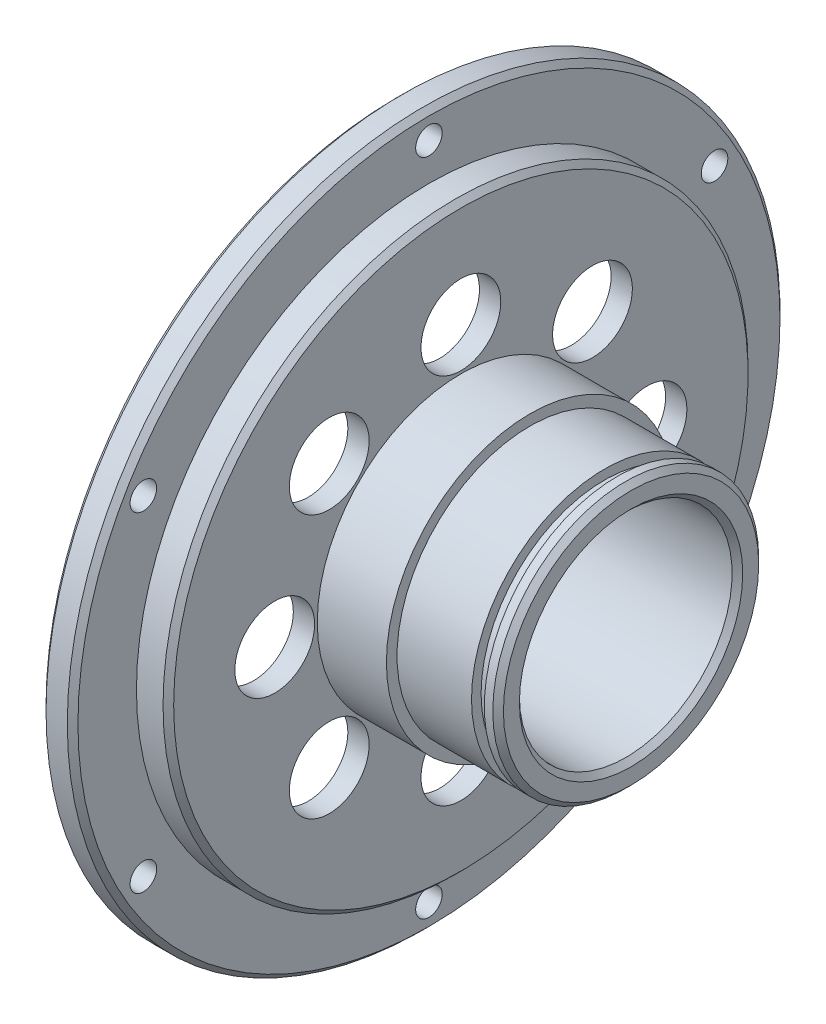
ISO-10303-21;
HEADER;
FILE_DESCRIPTION(('STEP AP214'),'2;1');
FILE_NAME('part.step','',(''),(''),'','','');
FILE_SCHEMA(('AUTOMOTIVE_DESIGN { 1 0 10303 214 1 1 1 1 }'));
ENDSEC;
DATA;
#1=APPLICATION_CONTEXT('core data for automotive mechanical design processes');
#2=APPLICATION_PROTOCOL_DEFINITION('international standard','automotive_design',2000,#1);
#3=PRODUCT_CONTEXT('',#1,'mechanical');
#4=PRODUCT('Part','Part','',(#3));
#5=PRODUCT_RELATED_PRODUCT_CATEGORY('part','',(#4));
#6=PRODUCT_DEFINITION_FORMATION('','',#4);
#7=PRODUCT_DEFINITION_CONTEXT('part definition',#1,'design');
#8=PRODUCT_DEFINITION('design','',#6,#7);
#9=PRODUCT_DEFINITION_SHAPE('','',#8);
#10=(LENGTH_UNIT() NAMED_UNIT(*) SI_UNIT(.MILLI.,.METRE.));
#11=(NAMED_UNIT(*) PLANE_ANGLE_UNIT() SI_UNIT($,.RADIAN.));
#12=(NAMED_UNIT(*) SI_UNIT($,.STERADIAN.) SOLID_ANGLE_UNIT());
#13=UNCERTAINTY_MEASURE_WITH_UNIT(LENGTH_MEASURE(1.E-05),#10,'distance_accuracy_value','');
#14=(GEOMETRIC_REPRESENTATION_CONTEXT(3) GLOBAL_UNCERTAINTY_ASSIGNED_CONTEXT((#13)) GLOBAL_UNIT_ASSIGNED_CONTEXT((#10,
#11,#12)) REPRESENTATION_CONTEXT('',''));
#15=CARTESIAN_POINT('',(0.,0.,0.));
#16=DIRECTION('',(0.,0.,1.));
#17=DIRECTION('',(1.,0.,0.));
#18=AXIS2_PLACEMENT_3D('',#15,#16,#17);
#19=CARTESIAN_POINT('',(22.,10.,0.));
#20=DIRECTION('',(-1.,0.,0.));
#21=DIRECTION('',(0.,0.,1.));
#22=AXIS2_PLACEMENT_3D('',#19,#20,#21);
#23=PLANE('',#22);
#24=CARTESIAN_POINT('',(22.,0.,0.));
#25=DIRECTION('',(-1.,0.,0.));
#26=DIRECTION('',(0.,0.,1.));
#27=AXIS2_PLACEMENT_3D('',#24,#25,#26);
#28=CIRCLE('',#27,12.);
#29=CARTESIAN_POINT('',(22.,0.,12.));
#30=VERTEX_POINT('',#29);
#31=EDGE_CURVE('E47',#30,#30,#28,.F.);
#32=ORIENTED_EDGE('',*,*,#31,.T.);
#33=EDGE_LOOP('',(#32));
#34=FACE_BOUND('',#33,.T.);
#35=CARTESIAN_POINT('',(22.,0.,0.));
#36=DIRECTION('',(-1.,0.,0.));
#37=DIRECTION('',(0.,0.,1.));
#38=AXIS2_PLACEMENT_3D('',#35,#36,#37);
#39=CIRCLE('',#38,10.5);
#40=CARTESIAN_POINT('',(22.,0.,10.5));
#41=VERTEX_POINT('',#40);
#42=EDGE_CURVE('E55',#41,#41,#39,.T.);
#43=ORIENTED_EDGE('',*,*,#42,.T.);
#44=EDGE_LOOP('',(#43));
#45=FACE_BOUND('',#44,.T.);
#46=ADVANCED_FACE('F39',(#34,#45),#23,.F.);
#47=CARTESIAN_POINT('',(0.,0.,0.));
#48=DIRECTION('',(-1.,0.,0.));
#49=DIRECTION('',(0.,0.,1.));
#50=AXIS2_PLACEMENT_3D('',#47,#48,#49);
#51=CYLINDRICAL_SURFACE('',#50,13.5);
#52=CARTESIAN_POINT('',(6.,0.,0.));
#53=DIRECTION('',(-1.,0.,0.));
#54=DIRECTION('',(0.,0.,1.));
#55=AXIS2_PLACEMENT_3D('',#52,#53,#54);
#56=CIRCLE('',#55,13.5);
#57=CARTESIAN_POINT('',(6.,0.,13.5));
#58=VERTEX_POINT('',#57);
#59=EDGE_CURVE('E113',#58,#58,#56,.T.);
#60=ORIENTED_EDGE('',*,*,#59,.F.);
#61=EDGE_LOOP('',(#60));
#62=FACE_BOUND('',#61,.T.);
#63=CARTESIAN_POINT('',(12.5,0.,0.));
#64=DIRECTION('',(1.,0.,0.));
#65=DIRECTION('',(0.,0.,-1.));
#66=AXIS2_PLACEMENT_3D('',#63,#64,#65);
#67=CIRCLE('',#66,13.5);
#68=CARTESIAN_POINT('',(12.5,0.,-13.5));
#69=VERTEX_POINT('',#68);
#70=EDGE_CURVE('E62',#69,#69,#67,.T.);
#71=ORIENTED_EDGE('',*,*,#70,.F.);
#72=EDGE_LOOP('',(#71));
#73=FACE_BOUND('',#72,.T.);
#74=ADVANCED_FACE('F218',(#62,#73),#51,.T.);
#75=CARTESIAN_POINT('',(0.,0.,0.));
#76=DIRECTION('',(-1.,0.,0.));
#77=DIRECTION('',(0.,0.,1.));
#78=AXIS2_PLACEMENT_3D('',#75,#76,#77);
#79=CYLINDRICAL_SURFACE('',#78,33.5);
#80=CARTESIAN_POINT('',(2.50000000000001,0.,0.));
#81=DIRECTION('',(-1.,0.,0.));
#82=DIRECTION('',(0.,0.,1.));
#83=AXIS2_PLACEMENT_3D('',#80,#81,#82);
#84=CIRCLE('',#83,33.5);
#85=CARTESIAN_POINT('',(2.50000000000001,0.,33.5));
#86=VERTEX_POINT('',#85);
#87=EDGE_CURVE('E92',#86,#86,#84,.T.);
#88=ORIENTED_EDGE('',*,*,#87,.T.);
#89=EDGE_LOOP('',(#88));
#90=FACE_BOUND('',#89,.T.);
#91=CARTESIAN_POINT('',(0.499999999999987,0.,0.));
#92=DIRECTION('',(1.,0.,0.));
#93=DIRECTION('',(0.,0.,-1.));
#94=AXIS2_PLACEMENT_3D('',#91,#92,#93);
#95=CIRCLE('',#94,33.5);
#96=CARTESIAN_POINT('',(0.499999999999987,0.,-33.5));
#97=VERTEX_POINT('',#96);
#98=EDGE_CURVE('E95',#97,#97,#95,.T.);
#99=ORIENTED_EDGE('',*,*,#98,.T.);
#100=EDGE_LOOP('',(#99));
#101=FACE_BOUND('',#100,.T.);
#102=ADVANCED_FACE('F220',(#90,#101),#79,.T.);
#103=CARTESIAN_POINT('',(0.,33.5,0.));
#104=DIRECTION('',(1.,0.,0.));
#105=DIRECTION('',(0.,0.,-1.));
#106=AXIS2_PLACEMENT_3D('',#103,#104,#105);
#107=PLANE('',#106);
#108=CARTESIAN_POINT('',(0.,15.5000000000003,26.8467875173174));
#109=DIRECTION('',(1.,0.,0.));
#110=DIRECTION('',(0.,0.,-1.));
#111=AXIS2_PLACEMENT_3D('',#108,#109,#110);
#112=CIRCLE('',#111,1.25);
#113=CARTESIAN_POINT('',(0.,15.5000000000003,25.5967875173174));
#114=VERTEX_POINT('',#113);
#115=EDGE_CURVE('E197',#114,#114,#112,.T.);
#116=ORIENTED_EDGE('',*,*,#115,.T.);
#117=EDGE_LOOP('',(#116));
#118=FACE_BOUND('',#117,.T.);
#119=CARTESIAN_POINT('',(0.,-15.4999999999997,26.8467875173177));
#120=DIRECTION('',(1.,0.,0.));
#121=DIRECTION('',(0.,0.,-1.));
#122=AXIS2_PLACEMENT_3D('',#119,#120,#121);
#123=CIRCLE('',#122,1.25);
#124=CARTESIAN_POINT('',(0.,-15.4999999999997,25.5967875173177));
#125=VERTEX_POINT('',#124);
#126=EDGE_CURVE('E191',#125,#125,#123,.T.);
#127=ORIENTED_EDGE('',*,*,#126,.T.);
#128=EDGE_LOOP('',(#127));
#129=FACE_BOUND('',#128,.T.);
#130=CARTESIAN_POINT('',(0.,-31.,0.));
#131=DIRECTION('',(1.,0.,0.));
#132=DIRECTION('',(0.,0.,-1.));
#133=AXIS2_PLACEMENT_3D('',#130,#131,#132);
#134=CIRCLE('',#133,1.25);
#135=CARTESIAN_POINT('',(0.,-31.,-1.25));
#136=VERTEX_POINT('',#135);
#137=EDGE_CURVE('E185',#136,#136,#134,.T.);
#138=ORIENTED_EDGE('',*,*,#137,.T.);
#139=EDGE_LOOP('',(#138));
#140=FACE_BOUND('',#139,.T.);
#141=CARTESIAN_POINT('',(0.,-15.5000000000001,-26.8467875173175));
#142=DIRECTION('',(1.,0.,0.));
#143=DIRECTION('',(0.,0.,-1.));
#144=AXIS2_PLACEMENT_3D('',#141,#142,#143);
#145=CIRCLE('',#144,1.25);
#146=CARTESIAN_POINT('',(0.,-15.5000000000001,-28.0967875173175));
#147=VERTEX_POINT('',#146);
#148=EDGE_CURVE('E179',#147,#147,#145,.T.);
#149=ORIENTED_EDGE('',*,*,#148,.T.);
#150=EDGE_LOOP('',(#149));
#151=FACE_BOUND('',#150,.T.);
#152=CARTESIAN_POINT('',(0.,15.4999999999999,-26.8467875173176));
#153=DIRECTION('',(1.,0.,0.));
#154=DIRECTION('',(0.,0.,-1.));
#155=AXIS2_PLACEMENT_3D('',#152,#153,#154);
#156=CIRCLE('',#155,1.25);
#157=CARTESIAN_POINT('',(0.,15.4999999999999,-28.0967875173176));
#158=VERTEX_POINT('',#157);
#159=EDGE_CURVE('E173',#158,#158,#156,.T.);
#160=ORIENTED_EDGE('',*,*,#159,.T.);
#161=EDGE_LOOP('',(#160));
#162=FACE_BOUND('',#161,.T.);
#163=CARTESIAN_POINT('',(0.,31.,0.));
#164=DIRECTION('',(1.,0.,0.));
#165=DIRECTION('',(0.,0.,-1.));
#166=AXIS2_PLACEMENT_3D('',#163,#164,#165);
#167=CIRCLE('',#166,1.25);
#168=CARTESIAN_POINT('',(0.,31.,-1.25));
#169=VERTEX_POINT('',#168);
#170=EDGE_CURVE('E151',#169,#169,#167,.T.);
#171=ORIENTED_EDGE('',*,*,#170,.T.);
#172=EDGE_LOOP('',(#171));
#173=FACE_BOUND('',#172,.T.);
#174=CARTESIAN_POINT('',(0.,0.,0.));
#175=DIRECTION('',(1.,0.,0.));
#176=DIRECTION('',(0.,0.,-1.));
#177=AXIS2_PLACEMENT_3D('',#174,#175,#176);
#178=CIRCLE('',#177,33.);
#179=CARTESIAN_POINT('',(0.,0.,-33.));
#180=VERTEX_POINT('',#179);
#181=EDGE_CURVE('E83',#180,#180,#178,.F.);
#182=ORIENTED_EDGE('',*,*,#181,.T.);
#183=EDGE_LOOP('',(#182));
#184=FACE_BOUND('',#183,.T.);
#185=CARTESIAN_POINT('',(0.,0.,0.));
#186=DIRECTION('',(1.,0.,0.));
#187=DIRECTION('',(0.,0.,-1.));
#188=AXIS2_PLACEMENT_3D('',#185,#186,#187);
#189=CIRCLE('',#188,26.);
#190=CARTESIAN_POINT('',(0.,0.,-26.));
#191=VERTEX_POINT('',#190);
#192=EDGE_CURVE('E86',#191,#191,#189,.T.);
#193=ORIENTED_EDGE('',*,*,#192,.T.);
#194=EDGE_LOOP('',(#193));
#195=FACE_BOUND('',#194,.T.);
#196=ADVANCED_FACE('F228',(#118,#129,#140,#151,#162,#173,#184,#195),#107,.F.);
#197=CARTESIAN_POINT('',(0.,0.,0.));
#198=DIRECTION('',(-1.,0.,0.));
#199=DIRECTION('',(0.,0.,1.));
#200=AXIS2_PLACEMENT_3D('',#197,#198,#199);
#201=CYLINDRICAL_SURFACE('',#200,25.5);
#202=CARTESIAN_POINT('',(0.500000000000001,0.,0.));
#203=DIRECTION('',(1.,0.,0.));
#204=DIRECTION('',(0.,0.,-1.));
#205=AXIS2_PLACEMENT_3D('',#202,#203,#204);
#206=CIRCLE('',#205,25.5);
#207=CARTESIAN_POINT('',(0.500000000000001,0.,-25.5));
#208=VERTEX_POINT('',#207);
#209=EDGE_CURVE('E74',#208,#208,#206,.F.);
#210=ORIENTED_EDGE('',*,*,#209,.T.);
#211=EDGE_LOOP('',(#210));
#212=FACE_BOUND('',#211,.T.);
#213=CARTESIAN_POINT('',(4.,0.,0.));
#214=DIRECTION('',(-1.,0.,0.));
#215=DIRECTION('',(0.,0.,1.));
#216=AXIS2_PLACEMENT_3D('',#213,#214,#215);
#217=CIRCLE('',#216,25.5);
#218=CARTESIAN_POINT('',(4.,0.,25.5));
#219=VERTEX_POINT('',#218);
#220=EDGE_CURVE('E98',#219,#219,#217,.T.);
#221=ORIENTED_EDGE('',*,*,#220,.F.);
#222=EDGE_LOOP('',(#221));
#223=FACE_BOUND('',#222,.T.);
#224=ADVANCED_FACE('F266',(#212,#223),#201,.F.);
#225=CARTESIAN_POINT('',(4.,25.5,0.));
#226=DIRECTION('',(1.,0.,0.));
#227=DIRECTION('',(0.,0.,-1.));
#228=AXIS2_PLACEMENT_3D('',#225,#226,#227);
#229=PLANE('',#228);
#230=CARTESIAN_POINT('',(4.,12.3743686707646,12.3743686707646));
#231=DIRECTION('',(1.,0.,0.));
#232=DIRECTION('',(0.,0.,-1.));
#233=AXIS2_PLACEMENT_3D('',#230,#231,#232);
#234=CIRCLE('',#233,3.75);
#235=CARTESIAN_POINT('',(4.,12.3743686707646,8.62436867076459));
#236=VERTEX_POINT('',#235);
#237=EDGE_CURVE('E119',#236,#236,#234,.T.);
#238=ORIENTED_EDGE('',*,*,#237,.T.);
#239=EDGE_LOOP('',(#238));
#240=FACE_BOUND('',#239,.T.);
#241=CARTESIAN_POINT('',(4.,0.,17.5));
#242=DIRECTION('',(1.,0.,0.));
#243=DIRECTION('',(0.,0.,-1.));
#244=AXIS2_PLACEMENT_3D('',#241,#242,#243);
#245=CIRCLE('',#244,3.75);
#246=CARTESIAN_POINT('',(4.,0.,13.75));
#247=VERTEX_POINT('',#246);
#248=EDGE_CURVE('E122',#247,#247,#245,.T.);
#249=ORIENTED_EDGE('',*,*,#248,.T.);
#250=EDGE_LOOP('',(#249));
#251=FACE_BOUND('',#250,.T.);
#252=CARTESIAN_POINT('',(4.,-12.3743686707646,12.3743686707646));
#253=DIRECTION('',(1.,0.,0.));
#254=DIRECTION('',(0.,0.,-1.));
#255=AXIS2_PLACEMENT_3D('',#252,#253,#254);
#256=CIRCLE('',#255,3.75);
#257=CARTESIAN_POINT('',(4.,-12.3743686707646,8.62436867076459));
#258=VERTEX_POINT('',#257);
#259=EDGE_CURVE('E125',#258,#258,#256,.T.);
#260=ORIENTED_EDGE('',*,*,#259,.T.);
#261=EDGE_LOOP('',(#260));
#262=FACE_BOUND('',#261,.T.);
#263=CARTESIAN_POINT('',(4.,-12.3743686707646,-12.3743686707646));
#264=DIRECTION('',(1.,0.,0.));
#265=DIRECTION('',(0.,0.,-1.));
#266=AXIS2_PLACEMENT_3D('',#263,#264,#265);
#267=CIRCLE('',#266,3.75);
#268=CARTESIAN_POINT('',(4.,-12.3743686707646,-16.1243686707646));
#269=VERTEX_POINT('',#268);
#270=EDGE_CURVE('E128',#269,#269,#267,.T.);
#271=ORIENTED_EDGE('',*,*,#270,.T.);
#272=EDGE_LOOP('',(#271));
#273=FACE_BOUND('',#272,.T.);
#274=CARTESIAN_POINT('',(4.,0.,-17.5));
#275=DIRECTION('',(1.,0.,0.));
#276=DIRECTION('',(0.,0.,-1.));
#277=AXIS2_PLACEMENT_3D('',#274,#275,#276);
#278=CIRCLE('',#277,3.75);
#279=CARTESIAN_POINT('',(4.,0.,-21.25));
#280=VERTEX_POINT('',#279);
#281=EDGE_CURVE('E131',#280,#280,#278,.T.);
#282=ORIENTED_EDGE('',*,*,#281,.T.);
#283=EDGE_LOOP('',(#282));
#284=FACE_BOUND('',#283,.T.);
#285=CARTESIAN_POINT('',(4.,12.3743686707646,-12.3743686707646));
#286=DIRECTION('',(1.,0.,0.));
#287=DIRECTION('',(0.,0.,-1.));
#288=AXIS2_PLACEMENT_3D('',#285,#286,#287);
#289=CIRCLE('',#288,3.75);
#290=CARTESIAN_POINT('',(4.,12.3743686707646,-16.1243686707646));
#291=VERTEX_POINT('',#290);
#292=EDGE_CURVE('E134',#291,#291,#289,.T.);
#293=ORIENTED_EDGE('',*,*,#292,.T.);
#294=EDGE_LOOP('',(#293));
#295=FACE_BOUND('',#294,.T.);
#296=CARTESIAN_POINT('',(4.,17.5,0.));
#297=DIRECTION('',(1.,0.,0.));
#298=DIRECTION('',(0.,0.,-1.));
#299=AXIS2_PLACEMENT_3D('',#296,#297,#298);
#300=CIRCLE('',#299,3.75);
#301=CARTESIAN_POINT('',(4.,17.5,-3.75));
#302=VERTEX_POINT('',#301);
#303=EDGE_CURVE('E137',#302,#302,#300,.T.);
#304=ORIENTED_EDGE('',*,*,#303,.T.);
#305=EDGE_LOOP('',(#304));
#306=FACE_BOUND('',#305,.T.);
#307=CARTESIAN_POINT('',(4.,-17.5,0.));
#308=DIRECTION('',(1.,0.,0.));
#309=DIRECTION('',(0.,0.,-1.));
#310=AXIS2_PLACEMENT_3D('',#307,#308,#309);
#311=CIRCLE('',#310,3.75);
#312=CARTESIAN_POINT('',(4.,-17.5,-3.75));
#313=VERTEX_POINT('',#312);
#314=EDGE_CURVE('E140',#313,#313,#311,.T.);
#315=ORIENTED_EDGE('',*,*,#314,.T.);
#316=EDGE_LOOP('',(#315));
#317=FACE_BOUND('',#316,.T.);
#318=CARTESIAN_POINT('',(4.,0.,0.));
#319=DIRECTION('',(1.,0.,0.));
#320=DIRECTION('',(0.,0.,-1.));
#321=AXIS2_PLACEMENT_3D('',#318,#319,#320);
#322=CIRCLE('',#321,9.49999999999999);
#323=CARTESIAN_POINT('',(4.,0.,-9.49999999999999));
#324=VERTEX_POINT('',#323);
#325=EDGE_CURVE('E68',#324,#324,#322,.T.);
#326=ORIENTED_EDGE('',*,*,#325,.T.);
#327=EDGE_LOOP('',(#326));
#328=FACE_BOUND('',#327,.T.);
#329=ORIENTED_EDGE('',*,*,#220,.T.);
#330=EDGE_LOOP('',(#329));
#331=FACE_BOUND('',#330,.T.);
#332=ADVANCED_FACE('F262',(#240,#251,#262,#273,#284,#295,#306,#317,#328,#331),#229,.F.);
#333=CARTESIAN_POINT('',(0.,0.,0.));
#334=DIRECTION('',(-1.,0.,0.));
#335=DIRECTION('',(0.,0.,1.));
#336=AXIS2_PLACEMENT_3D('',#333,#334,#335);
#337=CYLINDRICAL_SURFACE('',#336,9.);
#338=CARTESIAN_POINT('',(4.5,0.,0.));
#339=DIRECTION('',(1.,0.,0.));
#340=DIRECTION('',(0.,0.,-1.));
#341=AXIS2_PLACEMENT_3D('',#338,#339,#340);
#342=CIRCLE('',#341,9.);
#343=CARTESIAN_POINT('',(4.5,0.,-9.));
#344=VERTEX_POINT('',#343);
#345=EDGE_CURVE('E71',#344,#344,#342,.F.);
#346=ORIENTED_EDGE('',*,*,#345,.T.);
#347=EDGE_LOOP('',(#346));
#348=FACE_BOUND('',#347,.T.);
#349=CARTESIAN_POINT('',(6.,0.,0.));
#350=DIRECTION('',(-1.,0.,0.));
#351=DIRECTION('',(0.,0.,1.));
#352=AXIS2_PLACEMENT_3D('',#349,#350,#351);
#353=CIRCLE('',#352,9.);
#354=CARTESIAN_POINT('',(6.,0.,9.));
#355=VERTEX_POINT('',#354);
#356=EDGE_CURVE('E101',#355,#355,#353,.T.);
#357=ORIENTED_EDGE('',*,*,#356,.F.);
#358=EDGE_LOOP('',(#357));
#359=FACE_BOUND('',#358,.T.);
#360=ADVANCED_FACE('F258',(#348,#359),#337,.F.);
#361=CARTESIAN_POINT('',(6.,9.,0.));
#362=DIRECTION('',(-1.,0.,0.));
#363=DIRECTION('',(0.,0.,1.));
#364=AXIS2_PLACEMENT_3D('',#361,#362,#363);
#365=PLANE('',#364);
#366=CARTESIAN_POINT('',(6.,0.,0.));
#367=DIRECTION('',(-1.,0.,0.));
#368=DIRECTION('',(0.,0.,1.));
#369=AXIS2_PLACEMENT_3D('',#366,#367,#368);
#370=CIRCLE('',#369,10.);
#371=CARTESIAN_POINT('',(6.,0.,10.));
#372=VERTEX_POINT('',#371);
#373=EDGE_CURVE('E104',#372,#372,#370,.T.);
#374=ORIENTED_EDGE('',*,*,#373,.F.);
#375=EDGE_LOOP('',(#374));
#376=FACE_BOUND('',#375,.T.);
#377=ORIENTED_EDGE('',*,*,#356,.T.);
#378=EDGE_LOOP('',(#377));
#379=FACE_BOUND('',#378,.T.);
#380=ADVANCED_FACE('F254',(#376,#379),#365,.F.);
#381=CARTESIAN_POINT('',(0.,0.,0.));
#382=DIRECTION('',(-1.,0.,0.));
#383=DIRECTION('',(0.,0.,1.));
#384=AXIS2_PLACEMENT_3D('',#381,#382,#383);
#385=CYLINDRICAL_SURFACE('',#384,10.);
#386=CARTESIAN_POINT('',(21.5,0.,0.));
#387=DIRECTION('',(-1.,0.,0.));
#388=DIRECTION('',(0.,0.,1.));
#389=AXIS2_PLACEMENT_3D('',#386,#387,#388);
#390=CIRCLE('',#389,10.);
#391=CARTESIAN_POINT('',(21.5,0.,10.));
#392=VERTEX_POINT('',#391);
#393=EDGE_CURVE('E51',#392,#392,#390,.F.);
#394=ORIENTED_EDGE('',*,*,#393,.T.);
#395=EDGE_LOOP('',(#394));
#396=FACE_BOUND('',#395,.T.);
#397=ORIENTED_EDGE('',*,*,#373,.T.);
#398=EDGE_LOOP('',(#397));
#399=FACE_BOUND('',#398,.T.);
#400=ADVANCED_FACE('F251',(#396,#399),#385,.F.);
#401=CARTESIAN_POINT('',(6.,13.5,0.));
#402=DIRECTION('',(-1.,0.,0.));
#403=DIRECTION('',(0.,0.,1.));
#404=AXIS2_PLACEMENT_3D('',#401,#402,#403);
#405=PLANE('',#404);
#406=CARTESIAN_POINT('',(6.,12.3743686707646,12.3743686707646));
#407=DIRECTION('',(1.,0.,0.));
#408=DIRECTION('',(0.,0.,-1.));
#409=AXIS2_PLACEMENT_3D('',#406,#407,#408);
#410=CIRCLE('',#409,3.75);
#411=CARTESIAN_POINT('',(6.,12.3743686707646,8.62436867076459));
#412=VERTEX_POINT('',#411);
#413=EDGE_CURVE('E147',#412,#412,#410,.T.);
#414=ORIENTED_EDGE('',*,*,#413,.F.);
#415=EDGE_LOOP('',(#414));
#416=FACE_BOUND('',#415,.T.);
#417=CARTESIAN_POINT('',(6.,0.,17.5));
#418=DIRECTION('',(1.,0.,0.));
#419=DIRECTION('',(0.,0.,-1.));
#420=AXIS2_PLACEMENT_3D('',#417,#418,#419);
#421=CIRCLE('',#420,3.75);
#422=CARTESIAN_POINT('',(6.,0.,13.75));
#423=VERTEX_POINT('',#422);
#424=EDGE_CURVE('E150',#423,#423,#421,.T.);
#425=ORIENTED_EDGE('',*,*,#424,.F.);
#426=EDGE_LOOP('',(#425));
#427=FACE_BOUND('',#426,.T.);
#428=CARTESIAN_POINT('',(6.,-12.3743686707646,12.3743686707646));
#429=DIRECTION('',(1.,0.,0.));
#430=DIRECTION('',(0.,0.,-1.));
#431=AXIS2_PLACEMENT_3D('',#428,#429,#430);
#432=CIRCLE('',#431,3.75);
#433=CARTESIAN_POINT('',(6.,-12.3743686707646,8.62436867076459));
#434=VERTEX_POINT('',#433);
#435=EDGE_CURVE('E154',#434,#434,#432,.T.);
#436=ORIENTED_EDGE('',*,*,#435,.F.);
#437=EDGE_LOOP('',(#436));
#438=FACE_BOUND('',#437,.T.);
#439=CARTESIAN_POINT('',(6.,-12.3743686707646,-12.3743686707646));
#440=DIRECTION('',(1.,0.,0.));
#441=DIRECTION('',(0.,0.,-1.));
#442=AXIS2_PLACEMENT_3D('',#439,#440,#441);
#443=CIRCLE('',#442,3.75);
#444=CARTESIAN_POINT('',(6.,-12.3743686707646,-16.1243686707646));
#445=VERTEX_POINT('',#444);
#446=EDGE_CURVE('E157',#445,#445,#443,.T.);
#447=ORIENTED_EDGE('',*,*,#446,.F.);
#448=EDGE_LOOP('',(#447));
#449=FACE_BOUND('',#448,.T.);
#450=CARTESIAN_POINT('',(6.,0.,-17.5));
#451=DIRECTION('',(1.,0.,0.));
#452=DIRECTION('',(0.,0.,-1.));
#453=AXIS2_PLACEMENT_3D('',#450,#451,#452);
#454=CIRCLE('',#453,3.75);
#455=CARTESIAN_POINT('',(6.,0.,-21.25));
#456=VERTEX_POINT('',#455);
#457=EDGE_CURVE('E160',#456,#456,#454,.T.);
#458=ORIENTED_EDGE('',*,*,#457,.F.);
#459=EDGE_LOOP('',(#458));
#460=FACE_BOUND('',#459,.T.);
#461=CARTESIAN_POINT('',(6.,12.3743686707646,-12.3743686707646));
#462=DIRECTION('',(1.,0.,0.));
#463=DIRECTION('',(0.,0.,-1.));
#464=AXIS2_PLACEMENT_3D('',#461,#462,#463);
#465=CIRCLE('',#464,3.75);
#466=CARTESIAN_POINT('',(6.,12.3743686707646,-16.1243686707646));
#467=VERTEX_POINT('',#466);
#468=EDGE_CURVE('E163',#467,#467,#465,.T.);
#469=ORIENTED_EDGE('',*,*,#468,.F.);
#470=EDGE_LOOP('',(#469));
#471=FACE_BOUND('',#470,.T.);
#472=CARTESIAN_POINT('',(6.,17.5,0.));
#473=DIRECTION('',(1.,0.,0.));
#474=DIRECTION('',(0.,0.,-1.));
#475=AXIS2_PLACEMENT_3D('',#472,#473,#474);
#476=CIRCLE('',#475,3.75);
#477=CARTESIAN_POINT('',(6.,17.5,-3.75));
#478=VERTEX_POINT('',#477);
#479=EDGE_CURVE('E146',#478,#478,#476,.T.);
#480=ORIENTED_EDGE('',*,*,#479,.F.);
#481=EDGE_LOOP('',(#480));
#482=FACE_BOUND('',#481,.T.);
#483=CARTESIAN_POINT('',(6.,-17.5,0.));
#484=DIRECTION('',(1.,0.,0.));
#485=DIRECTION('',(0.,0.,-1.));
#486=AXIS2_PLACEMENT_3D('',#483,#484,#485);
#487=CIRCLE('',#486,3.75);
#488=CARTESIAN_POINT('',(6.,-17.5,-3.75));
#489=VERTEX_POINT('',#488);
#490=EDGE_CURVE('E143',#489,#489,#487,.T.);
#491=ORIENTED_EDGE('',*,*,#490,.F.);
#492=EDGE_LOOP('',(#491));
#493=FACE_BOUND('',#492,.T.);
#494=CARTESIAN_POINT('',(6.,0.,0.));
#495=DIRECTION('',(-1.,0.,0.));
#496=DIRECTION('',(0.,0.,1.));
#497=AXIS2_PLACEMENT_3D('',#494,#495,#496);
#498=CIRCLE('',#497,27.);
#499=CARTESIAN_POINT('',(6.,0.,27.));
#500=VERTEX_POINT('',#499);
#501=EDGE_CURVE('E77',#500,#500,#498,.F.);
#502=ORIENTED_EDGE('',*,*,#501,.T.);
#503=EDGE_LOOP('',(#502));
#504=FACE_BOUND('',#503,.T.);
#505=ORIENTED_EDGE('',*,*,#59,.T.);
#506=EDGE_LOOP('',(#505));
#507=FACE_BOUND('',#506,.T.);
#508=ADVANCED_FACE('F236',(#416,#427,#438,#449,#460,#471,#482,#493,#504,#507),#405,.F.);
#509=CARTESIAN_POINT('',(0.,0.,0.));
#510=DIRECTION('',(-1.,0.,0.));
#511=DIRECTION('',(0.,0.,1.));
#512=AXIS2_PLACEMENT_3D('',#509,#510,#511);
#513=CYLINDRICAL_SURFACE('',#512,27.5);
#514=CARTESIAN_POINT('',(5.5,0.,0.));
#515=DIRECTION('',(-1.,0.,0.));
#516=DIRECTION('',(0.,0.,1.));
#517=AXIS2_PLACEMENT_3D('',#514,#515,#516);
#518=CIRCLE('',#517,27.5);
#519=CARTESIAN_POINT('',(5.5,0.,27.5));
#520=VERTEX_POINT('',#519);
#521=EDGE_CURVE('E80',#520,#520,#518,.T.);
#522=ORIENTED_EDGE('',*,*,#521,.T.);
#523=EDGE_LOOP('',(#522));
#524=FACE_BOUND('',#523,.T.);
#525=CARTESIAN_POINT('',(3.,0.,0.));
#526=DIRECTION('',(-1.,0.,0.));
#527=DIRECTION('',(0.,0.,1.));
#528=AXIS2_PLACEMENT_3D('',#525,#526,#527);
#529=CIRCLE('',#528,27.5);
#530=CARTESIAN_POINT('',(3.,0.,27.5));
#531=VERTEX_POINT('',#530);
#532=EDGE_CURVE('E116',#531,#531,#529,.T.);
#533=ORIENTED_EDGE('',*,*,#532,.F.);
#534=EDGE_LOOP('',(#533));
#535=FACE_BOUND('',#534,.T.);
#536=ADVANCED_FACE('F343',(#524,#535),#513,.T.);
#537=CARTESIAN_POINT('',(3.,27.5,0.));
#538=DIRECTION('',(-1.,0.,0.));
#539=DIRECTION('',(0.,0.,1.));
#540=AXIS2_PLACEMENT_3D('',#537,#538,#539);
#541=PLANE('',#540);
#542=CARTESIAN_POINT('',(3.,15.5000000000003,26.8467875173174));
#543=DIRECTION('',(1.,0.,0.));
#544=DIRECTION('',(0.,0.,-1.));
#545=AXIS2_PLACEMENT_3D('',#542,#543,#544);
#546=CIRCLE('',#545,1.25);
#547=CARTESIAN_POINT('',(3.,15.5000000000003,25.5967875173174));
#548=VERTEX_POINT('',#547);
#549=EDGE_CURVE('E200',#548,#548,#546,.T.);
#550=ORIENTED_EDGE('',*,*,#549,.F.);
#551=EDGE_LOOP('',(#550));
#552=FACE_BOUND('',#551,.T.);
#553=CARTESIAN_POINT('',(3.,-15.4999999999997,26.8467875173177));
#554=DIRECTION('',(1.,0.,0.));
#555=DIRECTION('',(0.,0.,-1.));
#556=AXIS2_PLACEMENT_3D('',#553,#554,#555);
#557=CIRCLE('',#556,1.25);
#558=CARTESIAN_POINT('',(3.,-15.4999999999997,25.5967875173177));
#559=VERTEX_POINT('',#558);
#560=EDGE_CURVE('E194',#559,#559,#557,.T.);
#561=ORIENTED_EDGE('',*,*,#560,.F.);
#562=EDGE_LOOP('',(#561));
#563=FACE_BOUND('',#562,.T.);
#564=CARTESIAN_POINT('',(3.,-31.,0.));
#565=DIRECTION('',(1.,0.,0.));
#566=DIRECTION('',(0.,0.,-1.));
#567=AXIS2_PLACEMENT_3D('',#564,#565,#566);
#568=CIRCLE('',#567,1.25);
#569=CARTESIAN_POINT('',(3.,-31.,-1.25));
#570=VERTEX_POINT('',#569);
#571=EDGE_CURVE('E188',#570,#570,#568,.T.);
#572=ORIENTED_EDGE('',*,*,#571,.F.);
#573=EDGE_LOOP('',(#572));
#574=FACE_BOUND('',#573,.T.);
#575=CARTESIAN_POINT('',(3.,-15.5000000000001,-26.8467875173175));
#576=DIRECTION('',(1.,0.,0.));
#577=DIRECTION('',(0.,0.,-1.));
#578=AXIS2_PLACEMENT_3D('',#575,#576,#577);
#579=CIRCLE('',#578,1.25);
#580=CARTESIAN_POINT('',(3.,-15.5000000000001,-28.0967875173175));
#581=VERTEX_POINT('',#580);
#582=EDGE_CURVE('E182',#581,#581,#579,.T.);
#583=ORIENTED_EDGE('',*,*,#582,.F.);
#584=EDGE_LOOP('',(#583));
#585=FACE_BOUND('',#584,.T.);
#586=CARTESIAN_POINT('',(3.,15.4999999999999,-26.8467875173176));
#587=DIRECTION('',(1.,0.,0.));
#588=DIRECTION('',(0.,0.,-1.));
#589=AXIS2_PLACEMENT_3D('',#586,#587,#588);
#590=CIRCLE('',#589,1.25);
#591=CARTESIAN_POINT('',(3.,15.4999999999999,-28.0967875173176));
#592=VERTEX_POINT('',#591);
#593=EDGE_CURVE('E176',#592,#592,#590,.T.);
#594=ORIENTED_EDGE('',*,*,#593,.F.);
#595=EDGE_LOOP('',(#594));
#596=FACE_BOUND('',#595,.T.);
#597=CARTESIAN_POINT('',(3.,31.,0.));
#598=DIRECTION('',(1.,0.,0.));
#599=DIRECTION('',(0.,0.,-1.));
#600=AXIS2_PLACEMENT_3D('',#597,#598,#599);
#601=CIRCLE('',#600,1.25);
#602=CARTESIAN_POINT('',(3.,31.,-1.25));
#603=VERTEX_POINT('',#602);
#604=EDGE_CURVE('E170',#603,#603,#601,.T.);
#605=ORIENTED_EDGE('',*,*,#604,.F.);
#606=EDGE_LOOP('',(#605));
#607=FACE_BOUND('',#606,.T.);
#608=CARTESIAN_POINT('',(3.,0.,0.));
#609=DIRECTION('',(-1.,0.,0.));
#610=DIRECTION('',(0.,0.,1.));
#611=AXIS2_PLACEMENT_3D('',#608,#609,#610);
#612=CIRCLE('',#611,33.);
#613=CARTESIAN_POINT('',(3.,0.,33.));
#614=VERTEX_POINT('',#613);
#615=EDGE_CURVE('E89',#614,#614,#612,.F.);
#616=ORIENTED_EDGE('',*,*,#615,.T.);
#617=EDGE_LOOP('',(#616));
#618=FACE_BOUND('',#617,.T.);
#619=ORIENTED_EDGE('',*,*,#532,.T.);
#620=EDGE_LOOP('',(#619));
#621=FACE_BOUND('',#620,.T.);
#622=ADVANCED_FACE('F282',(#552,#563,#574,#585,#596,#607,#618,#621),#541,.F.);
#623=CARTESIAN_POINT('',(2.50000000000001,0.,0.));
#624=DIRECTION('',(-1.,0.,0.));
#625=DIRECTION('',(0.,0.,1.));
#626=AXIS2_PLACEMENT_3D('',#623,#624,#625);
#627=CONICAL_SURFACE('',#626,33.5,0.785398163397455);
#628=ORIENTED_EDGE('',*,*,#615,.F.);
#629=EDGE_LOOP('',(#628));
#630=FACE_BOUND('',#629,.T.);
#631=ORIENTED_EDGE('',*,*,#87,.F.);
#632=EDGE_LOOP('',(#631));
#633=FACE_BOUND('',#632,.T.);
#634=ADVANCED_FACE('F275',(#630,#633),#627,.T.);
#635=CARTESIAN_POINT('',(0.,0.,0.));
#636=DIRECTION('',(1.,0.,0.));
#637=DIRECTION('',(0.,0.,-1.));
#638=AXIS2_PLACEMENT_3D('',#635,#636,#637);
#639=CONICAL_SURFACE('',#638,33.,0.785398163397455);
#640=ORIENTED_EDGE('',*,*,#98,.F.);
#641=EDGE_LOOP('',(#640));
#642=FACE_BOUND('',#641,.T.);
#643=ORIENTED_EDGE('',*,*,#181,.F.);
#644=EDGE_LOOP('',(#643));
#645=FACE_BOUND('',#644,.T.);
#646=ADVANCED_FACE('F281',(#642,#645),#639,.T.);
#647=CARTESIAN_POINT('',(5.5,0.,0.));
#648=DIRECTION('',(-1.,0.,0.));
#649=DIRECTION('',(0.,0.,1.));
#650=AXIS2_PLACEMENT_3D('',#647,#648,#649);
#651=CONICAL_SURFACE('',#650,27.5,0.785398163397452);
#652=ORIENTED_EDGE('',*,*,#501,.F.);
#653=EDGE_LOOP('',(#652));
#654=FACE_BOUND('',#653,.T.);
#655=ORIENTED_EDGE('',*,*,#521,.F.);
#656=EDGE_LOOP('',(#655));
#657=FACE_BOUND('',#656,.T.);
#658=ADVANCED_FACE('F289',(#654,#657),#651,.T.);
#659=CARTESIAN_POINT('',(0.500000000000001,0.,0.));
#660=DIRECTION('',(-1.,0.,0.));
#661=DIRECTION('',(0.,0.,1.));
#662=AXIS2_PLACEMENT_3D('',#659,#660,#661);
#663=CONICAL_SURFACE('',#662,25.5,0.785398163397459);
#664=ORIENTED_EDGE('',*,*,#192,.F.);
#665=EDGE_LOOP('',(#664));
#666=FACE_BOUND('',#665,.T.);
#667=ORIENTED_EDGE('',*,*,#209,.F.);
#668=EDGE_LOOP('',(#667));
#669=FACE_BOUND('',#668,.T.);
#670=ADVANCED_FACE('F296',(#666,#669),#663,.F.);
#671=CARTESIAN_POINT('',(4.5,0.,0.));
#672=DIRECTION('',(-1.,0.,0.));
#673=DIRECTION('',(0.,0.,1.));
#674=AXIS2_PLACEMENT_3D('',#671,#672,#673);
#675=CONICAL_SURFACE('',#674,9.,0.785398163397445);
#676=ORIENTED_EDGE('',*,*,#325,.F.);
#677=EDGE_LOOP('',(#676));
#678=FACE_BOUND('',#677,.T.);
#679=ORIENTED_EDGE('',*,*,#345,.F.);
#680=EDGE_LOOP('',(#679));
#681=FACE_BOUND('',#680,.T.);
#682=ADVANCED_FACE('F303',(#678,#681),#675,.F.);
#683=CARTESIAN_POINT('',(22.,0.,0.));
#684=DIRECTION('',(1.,0.,0.));
#685=DIRECTION('',(0.,0.,-1.));
#686=AXIS2_PLACEMENT_3D('',#683,#684,#685);
#687=CONICAL_SURFACE('',#686,10.5,0.785398163397436);
#688=ORIENTED_EDGE('',*,*,#393,.F.);
#689=EDGE_LOOP('',(#688));
#690=FACE_BOUND('',#689,.T.);
#691=ORIENTED_EDGE('',*,*,#42,.F.);
#692=EDGE_LOOP('',(#691));
#693=FACE_BOUND('',#692,.T.);
#694=ADVANCED_FACE('F309',(#690,#693),#687,.F.);
#695=CARTESIAN_POINT('',(-4.,-17.5,0.));
#696=DIRECTION('',(1.,0.,0.));
#697=DIRECTION('',(0.,0.,-1.));
#698=AXIS2_PLACEMENT_3D('',#695,#696,#697);
#699=CYLINDRICAL_SURFACE('',#698,3.75);
#700=ORIENTED_EDGE('',*,*,#490,.T.);
#701=EDGE_LOOP('',(#700));
#702=FACE_BOUND('',#701,.T.);
#703=ORIENTED_EDGE('',*,*,#314,.F.);
#704=EDGE_LOOP('',(#703));
#705=FACE_BOUND('',#704,.T.);
#706=ADVANCED_FACE('F314',(#702,#705),#699,.F.);
#707=CARTESIAN_POINT('',(-4.,17.5,0.));
#708=DIRECTION('',(1.,0.,0.));
#709=DIRECTION('',(0.,0.,-1.));
#710=AXIS2_PLACEMENT_3D('',#707,#708,#709);
#711=CYLINDRICAL_SURFACE('',#710,3.75);
#712=ORIENTED_EDGE('',*,*,#479,.T.);
#713=EDGE_LOOP('',(#712));
#714=FACE_BOUND('',#713,.T.);
#715=ORIENTED_EDGE('',*,*,#303,.F.);
#716=EDGE_LOOP('',(#715));
#717=FACE_BOUND('',#716,.T.);
#718=ADVANCED_FACE('F319',(#714,#717),#711,.F.);
#719=CARTESIAN_POINT('',(-4.,12.3743686707646,-12.3743686707646));
#720=DIRECTION('',(1.,0.,0.));
#721=DIRECTION('',(0.,0.,-1.));
#722=AXIS2_PLACEMENT_3D('',#719,#720,#721);
#723=CYLINDRICAL_SURFACE('',#722,3.75);
#724=ORIENTED_EDGE('',*,*,#468,.T.);
#725=EDGE_LOOP('',(#724));
#726=FACE_BOUND('',#725,.T.);
#727=ORIENTED_EDGE('',*,*,#292,.F.);
#728=EDGE_LOOP('',(#727));
#729=FACE_BOUND('',#728,.T.);
#730=ADVANCED_FACE('F334',(#726,#729),#723,.F.);
#731=CARTESIAN_POINT('',(-4.,0.,-17.5));
#732=DIRECTION('',(1.,0.,0.));
#733=DIRECTION('',(0.,0.,-1.));
#734=AXIS2_PLACEMENT_3D('',#731,#732,#733);
#735=CYLINDRICAL_SURFACE('',#734,3.75);
#736=ORIENTED_EDGE('',*,*,#457,.T.);
#737=EDGE_LOOP('',(#736));
#738=FACE_BOUND('',#737,.T.);
#739=ORIENTED_EDGE('',*,*,#281,.F.);
#740=EDGE_LOOP('',(#739));
#741=FACE_BOUND('',#740,.T.);
#742=ADVANCED_FACE('F391',(#738,#741),#735,.F.);
#743=CARTESIAN_POINT('',(-4.,-12.3743686707646,-12.3743686707646));
#744=DIRECTION('',(1.,0.,0.));
#745=DIRECTION('',(0.,0.,-1.));
#746=AXIS2_PLACEMENT_3D('',#743,#744,#745);
#747=CYLINDRICAL_SURFACE('',#746,3.75);
#748=ORIENTED_EDGE('',*,*,#446,.T.);
#749=EDGE_LOOP('',(#748));
#750=FACE_BOUND('',#749,.T.);
#751=ORIENTED_EDGE('',*,*,#270,.F.);
#752=EDGE_LOOP('',(#751));
#753=FACE_BOUND('',#752,.T.);
#754=ADVANCED_FACE('F398',(#750,#753),#747,.F.);
#755=CARTESIAN_POINT('',(-4.,-12.3743686707646,12.3743686707646));
#756=DIRECTION('',(1.,0.,0.));
#757=DIRECTION('',(0.,0.,-1.));
#758=AXIS2_PLACEMENT_3D('',#755,#756,#757);
#759=CYLINDRICAL_SURFACE('',#758,3.75);
#760=ORIENTED_EDGE('',*,*,#435,.T.);
#761=EDGE_LOOP('',(#760));
#762=FACE_BOUND('',#761,.T.);
#763=ORIENTED_EDGE('',*,*,#259,.F.);
#764=EDGE_LOOP('',(#763));
#765=FACE_BOUND('',#764,.T.);
#766=ADVANCED_FACE('F405',(#762,#765),#759,.F.);
#767=CARTESIAN_POINT('',(-4.,0.,17.5));
#768=DIRECTION('',(1.,0.,0.));
#769=DIRECTION('',(0.,0.,-1.));
#770=AXIS2_PLACEMENT_3D('',#767,#768,#769);
#771=CYLINDRICAL_SURFACE('',#770,3.75);
#772=ORIENTED_EDGE('',*,*,#424,.T.);
#773=EDGE_LOOP('',(#772));
#774=FACE_BOUND('',#773,.T.);
#775=ORIENTED_EDGE('',*,*,#248,.F.);
#776=EDGE_LOOP('',(#775));
#777=FACE_BOUND('',#776,.T.);
#778=ADVANCED_FACE('F408',(#774,#777),#771,.F.);
#779=CARTESIAN_POINT('',(-4.,12.3743686707646,12.3743686707646));
#780=DIRECTION('',(1.,0.,0.));
#781=DIRECTION('',(0.,0.,-1.));
#782=AXIS2_PLACEMENT_3D('',#779,#780,#781);
#783=CYLINDRICAL_SURFACE('',#782,3.75);
#784=ORIENTED_EDGE('',*,*,#413,.T.);
#785=EDGE_LOOP('',(#784));
#786=FACE_BOUND('',#785,.T.);
#787=ORIENTED_EDGE('',*,*,#237,.F.);
#788=EDGE_LOOP('',(#787));
#789=FACE_BOUND('',#788,.T.);
#790=ADVANCED_FACE('F340',(#786,#789),#783,.F.);
#791=CARTESIAN_POINT('',(3.,31.,0.));
#792=DIRECTION('',(1.,0.,0.));
#793=DIRECTION('',(0.,0.,-1.));
#794=AXIS2_PLACEMENT_3D('',#791,#792,#793);
#795=CYLINDRICAL_SURFACE('',#794,1.25);
#796=ORIENTED_EDGE('',*,*,#604,.T.);
#797=EDGE_LOOP('',(#796));
#798=FACE_BOUND('',#797,.T.);
#799=ORIENTED_EDGE('',*,*,#170,.F.);
#800=EDGE_LOOP('',(#799));
#801=FACE_BOUND('',#800,.T.);
#802=ADVANCED_FACE('F415',(#798,#801),#795,.F.);
#803=CARTESIAN_POINT('',(3.,15.4999999999999,-26.8467875173176));
#804=DIRECTION('',(1.,0.,0.));
#805=DIRECTION('',(0.,0.,-1.));
#806=AXIS2_PLACEMENT_3D('',#803,#804,#805);
#807=CYLINDRICAL_SURFACE('',#806,1.25);
#808=ORIENTED_EDGE('',*,*,#593,.T.);
#809=EDGE_LOOP('',(#808));
#810=FACE_BOUND('',#809,.T.);
#811=ORIENTED_EDGE('',*,*,#159,.F.);
#812=EDGE_LOOP('',(#811));
#813=FACE_BOUND('',#812,.T.);
#814=ADVANCED_FACE('F432',(#810,#813),#807,.F.);
#815=CARTESIAN_POINT('',(3.,-15.5000000000001,-26.8467875173175));
#816=DIRECTION('',(1.,0.,0.));
#817=DIRECTION('',(0.,0.,-1.));
#818=AXIS2_PLACEMENT_3D('',#815,#816,#817);
#819=CYLINDRICAL_SURFACE('',#818,1.25);
#820=ORIENTED_EDGE('',*,*,#582,.T.);
#821=EDGE_LOOP('',(#820));
#822=FACE_BOUND('',#821,.T.);
#823=ORIENTED_EDGE('',*,*,#148,.F.);
#824=EDGE_LOOP('',(#823));
#825=FACE_BOUND('',#824,.T.);
#826=ADVANCED_FACE('F440',(#822,#825),#819,.F.);
#827=CARTESIAN_POINT('',(3.,-31.,0.));
#828=DIRECTION('',(1.,0.,0.));
#829=DIRECTION('',(0.,0.,-1.));
#830=AXIS2_PLACEMENT_3D('',#827,#828,#829);
#831=CYLINDRICAL_SURFACE('',#830,1.25);
#832=ORIENTED_EDGE('',*,*,#571,.T.);
#833=EDGE_LOOP('',(#832));
#834=FACE_BOUND('',#833,.T.);
#835=ORIENTED_EDGE('',*,*,#137,.F.);
#836=EDGE_LOOP('',(#835));
#837=FACE_BOUND('',#836,.T.);
#838=ADVANCED_FACE('F447',(#834,#837),#831,.F.);
#839=CARTESIAN_POINT('',(3.,-15.4999999999997,26.8467875173177));
#840=DIRECTION('',(1.,0.,0.));
#841=DIRECTION('',(0.,0.,-1.));
#842=AXIS2_PLACEMENT_3D('',#839,#840,#841);
#843=CYLINDRICAL_SURFACE('',#842,1.25);
#844=ORIENTED_EDGE('',*,*,#560,.T.);
#845=EDGE_LOOP('',(#844));
#846=FACE_BOUND('',#845,.T.);
#847=ORIENTED_EDGE('',*,*,#126,.F.);
#848=EDGE_LOOP('',(#847));
#849=FACE_BOUND('',#848,.T.);
#850=ADVANCED_FACE('F451',(#846,#849),#843,.F.);
#851=CARTESIAN_POINT('',(3.,15.5000000000003,26.8467875173174));
#852=DIRECTION('',(1.,0.,0.));
#853=DIRECTION('',(0.,0.,-1.));
#854=AXIS2_PLACEMENT_3D('',#851,#852,#853);
#855=CYLINDRICAL_SURFACE('',#854,1.25);
#856=ORIENTED_EDGE('',*,*,#549,.T.);
#857=EDGE_LOOP('',(#856));
#858=FACE_BOUND('',#857,.T.);
#859=ORIENTED_EDGE('',*,*,#115,.F.);
#860=EDGE_LOOP('',(#859));
#861=FACE_BOUND('',#860,.T.);
#862=ADVANCED_FACE('F214',(#858,#861),#855,.F.);
#863=CARTESIAN_POINT('',(12.5,0.,0.));
#864=DIRECTION('',(1.,0.,0.));
#865=DIRECTION('',(0.,0.,-1.));
#866=AXIS2_PLACEMENT_3D('',#863,#864,#865);
#867=PLANE('',#866);
#868=CARTESIAN_POINT('',(12.5,0.,0.));
#869=DIRECTION('',(1.,0.,0.));
#870=DIRECTION('',(0.,0.,-1.));
#871=AXIS2_PLACEMENT_3D('',#868,#869,#870);
#872=CIRCLE('',#871,12.5);
#873=CARTESIAN_POINT('',(12.5,0.,-12.5));
#874=VERTEX_POINT('',#873);
#875=EDGE_CURVE('E64',#874,#874,#872,.T.);
#876=ORIENTED_EDGE('',*,*,#875,.F.);
#877=EDGE_LOOP('',(#876));
#878=FACE_BOUND('',#877,.T.);
#879=ORIENTED_EDGE('',*,*,#70,.T.);
#880=EDGE_LOOP('',(#879));
#881=FACE_BOUND('',#880,.T.);
#882=ADVANCED_FACE('F211',(#878,#881),#867,.T.);
#883=CARTESIAN_POINT('',(12.5,0.,0.));
#884=DIRECTION('',(1.,0.,0.));
#885=DIRECTION('',(0.,0.,-1.));
#886=AXIS2_PLACEMENT_3D('',#883,#884,#885);
#887=CYLINDRICAL_SURFACE('',#886,12.5);
#888=ORIENTED_EDGE('',*,*,#875,.T.);
#889=EDGE_LOOP('',(#888));
#890=FACE_BOUND('',#889,.T.);
#891=CARTESIAN_POINT('',(19.5,0.,0.));
#892=DIRECTION('',(-1.,0.,0.));
#893=DIRECTION('',(0.,0.,1.));
#894=AXIS2_PLACEMENT_3D('',#891,#892,#893);
#895=CIRCLE('',#894,12.5);
#896=CARTESIAN_POINT('',(19.5,0.,12.5));
#897=VERTEX_POINT('',#896);
#898=EDGE_CURVE('E58',#897,#897,#895,.T.);
#899=ORIENTED_EDGE('',*,*,#898,.T.);
#900=EDGE_LOOP('',(#899));
#901=FACE_BOUND('',#900,.T.);
#902=ADVANCED_FACE('F208',(#890,#901),#887,.T.);
#903=CARTESIAN_POINT('',(20.7,13.5,0.));
#904=DIRECTION('',(1.,0.,0.));
#905=DIRECTION('',(0.,0.,-1.));
#906=AXIS2_PLACEMENT_3D('',#903,#904,#905);
#907=PLANE('',#906);
#908=CARTESIAN_POINT('',(20.7,0.,0.));
#909=DIRECTION('',(-1.,0.,0.));
#910=DIRECTION('',(0.,0.,1.));
#911=AXIS2_PLACEMENT_3D('',#908,#909,#910);
#912=CIRCLE('',#911,11.6);
#913=CARTESIAN_POINT('',(20.7,0.,11.6));
#914=VERTEX_POINT('',#913);
#915=EDGE_CURVE('E107',#914,#914,#912,.T.);
#916=ORIENTED_EDGE('',*,*,#915,.F.);
#917=EDGE_LOOP('',(#916));
#918=FACE_BOUND('',#917,.T.);
#919=CARTESIAN_POINT('',(20.7,0.,0.));
#920=DIRECTION('',(1.,0.,0.));
#921=DIRECTION('',(0.,0.,-1.));
#922=AXIS2_PLACEMENT_3D('',#919,#920,#921);
#923=CIRCLE('',#922,12.5);
#924=CARTESIAN_POINT('',(20.7,0.,-12.5));
#925=VERTEX_POINT('',#924);
#926=EDGE_CURVE('E61',#925,#925,#923,.T.);
#927=ORIENTED_EDGE('',*,*,#926,.F.);
#928=EDGE_LOOP('',(#927));
#929=FACE_BOUND('',#928,.T.);
#930=ADVANCED_FACE('F246',(#918,#929),#907,.F.);
#931=CARTESIAN_POINT('',(0.,0.,0.));
#932=DIRECTION('',(-1.,0.,0.));
#933=DIRECTION('',(0.,0.,1.));
#934=AXIS2_PLACEMENT_3D('',#931,#932,#933);
#935=CYLINDRICAL_SURFACE('',#934,11.6);
#936=CARTESIAN_POINT('',(19.5,0.,0.));
#937=DIRECTION('',(-1.,0.,0.));
#938=DIRECTION('',(0.,0.,1.));
#939=AXIS2_PLACEMENT_3D('',#936,#937,#938);
#940=CIRCLE('',#939,11.6);
#941=CARTESIAN_POINT('',(19.5,0.,11.6));
#942=VERTEX_POINT('',#941);
#943=EDGE_CURVE('E110',#942,#942,#940,.T.);
#944=ORIENTED_EDGE('',*,*,#943,.F.);
#945=EDGE_LOOP('',(#944));
#946=FACE_BOUND('',#945,.T.);
#947=ORIENTED_EDGE('',*,*,#915,.T.);
#948=EDGE_LOOP('',(#947));
#949=FACE_BOUND('',#948,.T.);
#950=ADVANCED_FACE('F242',(#946,#949),#935,.T.);
#951=CARTESIAN_POINT('',(19.5,11.6,0.));
#952=DIRECTION('',(-1.,0.,0.));
#953=DIRECTION('',(0.,0.,1.));
#954=AXIS2_PLACEMENT_3D('',#951,#952,#953);
#955=PLANE('',#954);
#956=ORIENTED_EDGE('',*,*,#943,.T.);
#957=EDGE_LOOP('',(#956));
#958=FACE_BOUND('',#957,.T.);
#959=ORIENTED_EDGE('',*,*,#898,.F.);
#960=EDGE_LOOP('',(#959));
#961=FACE_BOUND('',#960,.T.);
#962=ADVANCED_FACE('F238',(#958,#961),#955,.F.);
#963=CARTESIAN_POINT('',(21.5,0.,0.));
#964=DIRECTION('',(-1.,0.,0.));
#965=DIRECTION('',(0.,0.,1.));
#966=AXIS2_PLACEMENT_3D('',#963,#964,#965);
#967=CIRCLE('',#966,12.5);
#968=CARTESIAN_POINT('',(21.5,0.,12.5));
#969=VERTEX_POINT('',#968);
#970=EDGE_CURVE('E11',#969,#969,#967,.T.);
#971=ORIENTED_EDGE('',*,*,#970,.T.);
#972=EDGE_LOOP('',(#971));
#973=FACE_BOUND('',#972,.T.);
#974=ORIENTED_EDGE('',*,*,#926,.T.);
#975=EDGE_LOOP('',(#974));
#976=FACE_BOUND('',#975,.T.);
#977=ADVANCED_FACE('F241',(#973,#976),#887,.T.);
#978=CARTESIAN_POINT('',(22.,0.,0.));
#979=DIRECTION('',(-1.,0.,0.));
#980=DIRECTION('',(0.,0.,1.));
#981=AXIS2_PLACEMENT_3D('',#978,#979,#980);
#982=CONICAL_SURFACE('',#981,12.,0.785398163397445);
#983=ORIENTED_EDGE('',*,*,#970,.F.);
#984=EDGE_LOOP('',(#983));
#985=FACE_BOUND('',#984,.T.);
#986=ORIENTED_EDGE('',*,*,#31,.F.);
#987=EDGE_LOOP('',(#986));
#988=FACE_BOUND('',#987,.T.);
#989=ADVANCED_FACE('F42',(#985,#988),#982,.T.);
#990=CLOSED_SHELL('',(#46,#74,#102,#196,#224,#332,#360,#380,#400,#508,#536,#622,#634,#646,#658,
#670,#682,#694,#706,#718,#730,#742,#754,#766,#778,#790,#802,#814,#826,#838,#850,#862,#882,#902,
#930,#950,#962,#977,#989));
#991=MANIFOLD_SOLID_BREP('B2',#990);
#992=ADVANCED_BREP_SHAPE_REPRESENTATION('',(#18,#991),#14);
#993=SHAPE_DEFINITION_REPRESENTATION(#9,#992);
ENDSEC;
END-ISO-10303-21;
